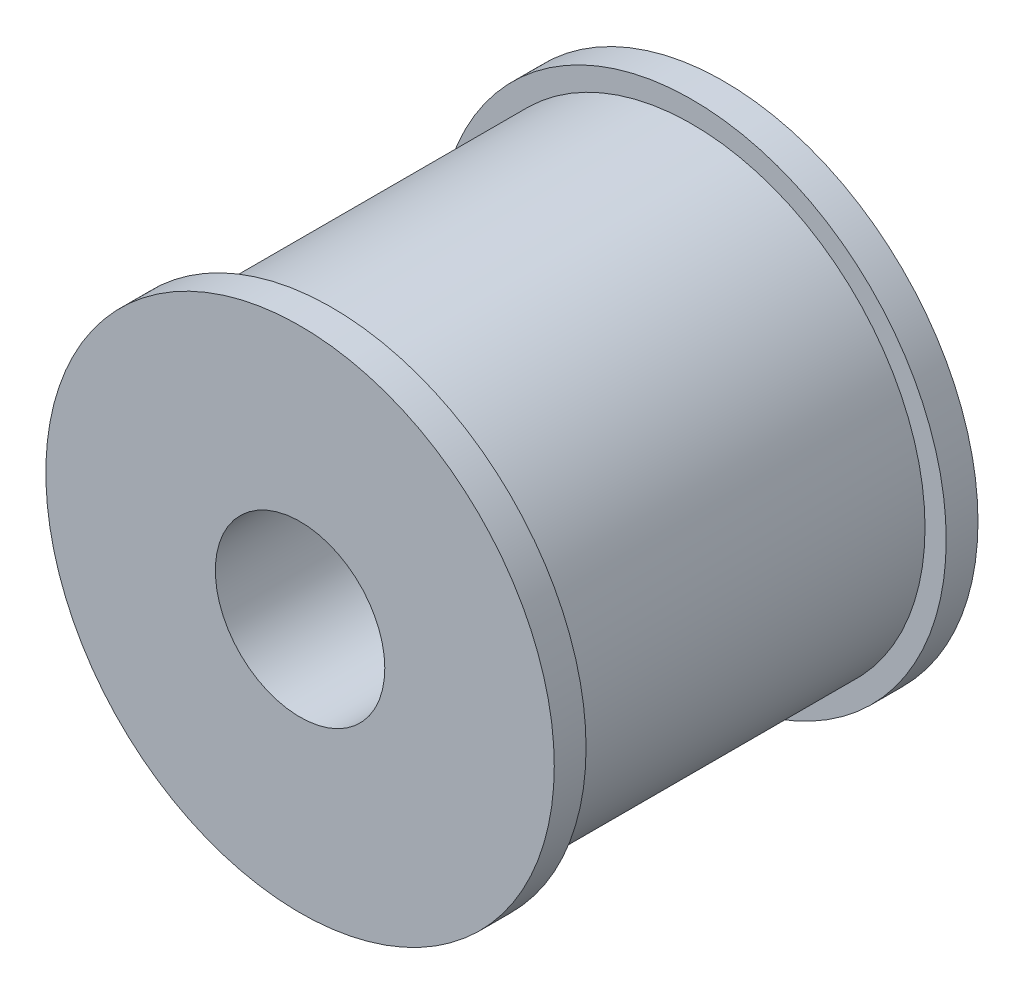
ISO-10303-21;
HEADER;
FILE_DESCRIPTION(('STEP AP214'),'2;1');
FILE_NAME('part.step','',(''),(''),'','','');
FILE_SCHEMA(('AUTOMOTIVE_DESIGN { 1 0 10303 214 1 1 1 1 }'));
ENDSEC;
DATA;
#1=APPLICATION_CONTEXT('core data for automotive mechanical design processes');
#2=APPLICATION_PROTOCOL_DEFINITION('international standard','automotive_design',2000,#1);
#3=PRODUCT_CONTEXT('',#1,'mechanical');
#4=PRODUCT('Part','Part','',(#3));
#5=PRODUCT_RELATED_PRODUCT_CATEGORY('part','',(#4));
#6=PRODUCT_DEFINITION_FORMATION('','',#4);
#7=PRODUCT_DEFINITION_CONTEXT('part definition',#1,'design');
#8=PRODUCT_DEFINITION('design','',#6,#7);
#9=PRODUCT_DEFINITION_SHAPE('','',#8);
#10=(LENGTH_UNIT() NAMED_UNIT(*) SI_UNIT(.MILLI.,.METRE.));
#11=(NAMED_UNIT(*) PLANE_ANGLE_UNIT() SI_UNIT($,.RADIAN.));
#12=(NAMED_UNIT(*) SI_UNIT($,.STERADIAN.) SOLID_ANGLE_UNIT());
#13=UNCERTAINTY_MEASURE_WITH_UNIT(LENGTH_MEASURE(1.E-05),#10,'distance_accuracy_value','');
#14=(GEOMETRIC_REPRESENTATION_CONTEXT(3) GLOBAL_UNCERTAINTY_ASSIGNED_CONTEXT((#13)) GLOBAL_UNIT_ASSIGNED_CONTEXT((#10,
#11,#12)) REPRESENTATION_CONTEXT('',''));
#15=CARTESIAN_POINT('',(0.,0.,0.));
#16=DIRECTION('',(0.,0.,1.));
#17=DIRECTION('',(1.,0.,0.));
#18=AXIS2_PLACEMENT_3D('',#15,#16,#17);
#19=CARTESIAN_POINT('',(0.,0.,20.));
#20=DIRECTION('',(0.,0.,-1.));
#21=DIRECTION('',(-1.,0.,0.));
#22=AXIS2_PLACEMENT_3D('',#19,#20,#21);
#23=CYLINDRICAL_SURFACE('',#22,12.);
#24=CARTESIAN_POINT('',(0.,0.,0.));
#25=DIRECTION('',(0.,0.,1.));
#26=DIRECTION('',(1.,0.,0.));
#27=AXIS2_PLACEMENT_3D('',#24,#25,#26);
#28=CIRCLE('',#27,12.);
#29=CARTESIAN_POINT('',(12.,0.,0.));
#30=VERTEX_POINT('',#29);
#31=EDGE_CURVE('E45',#30,#30,#28,.T.);
#32=ORIENTED_EDGE('',*,*,#31,.T.);
#33=EDGE_LOOP('',(#32));
#34=FACE_BOUND('',#33,.T.);
#35=CARTESIAN_POINT('',(0.,0.,1.5));
#36=DIRECTION('',(0.,0.,1.));
#37=DIRECTION('',(1.,0.,0.));
#38=AXIS2_PLACEMENT_3D('',#35,#36,#37);
#39=CIRCLE('',#38,12.);
#40=CARTESIAN_POINT('',(12.,0.,1.5));
#41=VERTEX_POINT('',#40);
#42=EDGE_CURVE('E40',#41,#41,#39,.T.);
#43=ORIENTED_EDGE('',*,*,#42,.F.);
#44=EDGE_LOOP('',(#43));
#45=FACE_BOUND('',#44,.T.);
#46=ADVANCED_FACE('F36',(#34,#45),#23,.T.);
#47=CARTESIAN_POINT('',(0.,0.,20.));
#48=DIRECTION('',(0.,0.,1.));
#49=DIRECTION('',(1.,0.,0.));
#50=AXIS2_PLACEMENT_3D('',#47,#48,#49);
#51=PLANE('',#50);
#52=CARTESIAN_POINT('',(0.,0.,20.));
#53=DIRECTION('',(0.,0.,1.));
#54=DIRECTION('',(1.,0.,0.));
#55=AXIS2_PLACEMENT_3D('',#52,#53,#54);
#56=CIRCLE('',#55,12.);
#57=CARTESIAN_POINT('',(12.,0.,20.));
#58=VERTEX_POINT('',#57);
#59=EDGE_CURVE('E10',#58,#58,#56,.T.);
#60=ORIENTED_EDGE('',*,*,#59,.T.);
#61=EDGE_LOOP('',(#60));
#62=FACE_BOUND('',#61,.T.);
#63=CARTESIAN_POINT('',(0.,0.,20.));
#64=DIRECTION('',(0.,0.,1.));
#65=DIRECTION('',(1.,0.,0.));
#66=AXIS2_PLACEMENT_3D('',#63,#64,#65);
#67=CIRCLE('',#66,4.);
#68=CARTESIAN_POINT('',(4.,0.,20.));
#69=VERTEX_POINT('',#68);
#70=EDGE_CURVE('E51',#69,#69,#67,.T.);
#71=ORIENTED_EDGE('',*,*,#70,.F.);
#72=EDGE_LOOP('',(#71));
#73=FACE_BOUND('',#72,.T.);
#74=ADVANCED_FACE('F99',(#62,#73),#51,.T.);
#75=CARTESIAN_POINT('',(0.,0.,0.));
#76=DIRECTION('',(0.,0.,1.));
#77=DIRECTION('',(1.,0.,0.));
#78=AXIS2_PLACEMENT_3D('',#75,#76,#77);
#79=PLANE('',#78);
#80=ORIENTED_EDGE('',*,*,#31,.F.);
#81=EDGE_LOOP('',(#80));
#82=FACE_BOUND('',#81,.T.);
#83=CARTESIAN_POINT('',(0.,0.,0.));
#84=DIRECTION('',(0.,0.,1.));
#85=DIRECTION('',(1.,0.,0.));
#86=AXIS2_PLACEMENT_3D('',#83,#84,#85);
#87=CIRCLE('',#86,4.);
#88=CARTESIAN_POINT('',(4.,0.,0.));
#89=VERTEX_POINT('',#88);
#90=EDGE_CURVE('E54',#89,#89,#87,.T.);
#91=ORIENTED_EDGE('',*,*,#90,.T.);
#92=EDGE_LOOP('',(#91));
#93=FACE_BOUND('',#92,.T.);
#94=ADVANCED_FACE('F81',(#82,#93),#79,.F.);
#95=CARTESIAN_POINT('',(0.,0.,18.5));
#96=DIRECTION('',(0.,0.,1.));
#97=DIRECTION('',(1.,0.,0.));
#98=AXIS2_PLACEMENT_3D('',#95,#96,#97);
#99=CIRCLE('',#98,12.);
#100=CARTESIAN_POINT('',(12.,0.,18.5));
#101=VERTEX_POINT('',#100);
#102=EDGE_CURVE('E56',#101,#101,#99,.T.);
#103=ORIENTED_EDGE('',*,*,#102,.T.);
#104=EDGE_LOOP('',(#103));
#105=FACE_BOUND('',#104,.T.);
#106=ORIENTED_EDGE('',*,*,#59,.F.);
#107=EDGE_LOOP('',(#106));
#108=FACE_BOUND('',#107,.T.);
#109=ADVANCED_FACE('F38',(#105,#108),#23,.T.);
#110=CARTESIAN_POINT('',(0.,0.,20.));
#111=DIRECTION('',(0.,0.,-1.));
#112=DIRECTION('',(-1.,0.,0.));
#113=AXIS2_PLACEMENT_3D('',#110,#111,#112);
#114=CYLINDRICAL_SURFACE('',#113,4.);
#115=ORIENTED_EDGE('',*,*,#70,.T.);
#116=EDGE_LOOP('',(#115));
#117=FACE_BOUND('',#116,.T.);
#118=ORIENTED_EDGE('',*,*,#90,.F.);
#119=EDGE_LOOP('',(#118));
#120=FACE_BOUND('',#119,.T.);
#121=ADVANCED_FACE('F83',(#117,#120),#114,.F.);
#122=CARTESIAN_POINT('',(0.,0.,1.5));
#123=DIRECTION('',(0.,0.,1.));
#124=DIRECTION('',(1.,0.,0.));
#125=AXIS2_PLACEMENT_3D('',#122,#123,#124);
#126=PLANE('',#125);
#127=CARTESIAN_POINT('',(0.,0.,1.5));
#128=DIRECTION('',(0.,0.,1.));
#129=DIRECTION('',(1.,0.,0.));
#130=AXIS2_PLACEMENT_3D('',#127,#128,#129);
#131=CIRCLE('',#130,11.);
#132=CARTESIAN_POINT('',(11.,0.,1.5));
#133=VERTEX_POINT('',#132);
#134=EDGE_CURVE('E59',#133,#133,#131,.T.);
#135=ORIENTED_EDGE('',*,*,#134,.F.);
#136=EDGE_LOOP('',(#135));
#137=FACE_BOUND('',#136,.T.);
#138=ORIENTED_EDGE('',*,*,#42,.T.);
#139=EDGE_LOOP('',(#138));
#140=FACE_BOUND('',#139,.T.);
#141=ADVANCED_FACE('F85',(#137,#140),#126,.T.);
#142=CARTESIAN_POINT('',(0.,0.,18.5));
#143=DIRECTION('',(0.,0.,1.));
#144=DIRECTION('',(1.,0.,0.));
#145=AXIS2_PLACEMENT_3D('',#142,#143,#144);
#146=PLANE('',#145);
#147=CARTESIAN_POINT('',(0.,0.,18.5));
#148=DIRECTION('',(0.,0.,1.));
#149=DIRECTION('',(1.,0.,0.));
#150=AXIS2_PLACEMENT_3D('',#147,#148,#149);
#151=CIRCLE('',#150,11.);
#152=CARTESIAN_POINT('',(11.,0.,18.5));
#153=VERTEX_POINT('',#152);
#154=EDGE_CURVE('E66',#153,#153,#151,.T.);
#155=ORIENTED_EDGE('',*,*,#154,.T.);
#156=EDGE_LOOP('',(#155));
#157=FACE_BOUND('',#156,.T.);
#158=ORIENTED_EDGE('',*,*,#102,.F.);
#159=EDGE_LOOP('',(#158));
#160=FACE_BOUND('',#159,.T.);
#161=ADVANCED_FACE('F92',(#157,#160),#146,.F.);
#162=CARTESIAN_POINT('',(0.,0.,1.5));
#163=DIRECTION('',(0.,0.,1.));
#164=DIRECTION('',(1.,0.,0.));
#165=AXIS2_PLACEMENT_3D('',#162,#163,#164);
#166=CYLINDRICAL_SURFACE('',#165,11.);
#167=ORIENTED_EDGE('',*,*,#134,.T.);
#168=EDGE_LOOP('',(#167));
#169=FACE_BOUND('',#168,.T.);
#170=ORIENTED_EDGE('',*,*,#154,.F.);
#171=EDGE_LOOP('',(#170));
#172=FACE_BOUND('',#171,.T.);
#173=ADVANCED_FACE('F133',(#169,#172),#166,.T.);
#174=CLOSED_SHELL('',(#46,#74,#94,#109,#121,#141,#161,#173));
#175=MANIFOLD_SOLID_BREP('B2',#174);
#176=ADVANCED_BREP_SHAPE_REPRESENTATION('',(#18,#175),#14);
#177=SHAPE_DEFINITION_REPRESENTATION(#9,#176);
ENDSEC;
END-ISO-10303-21;
